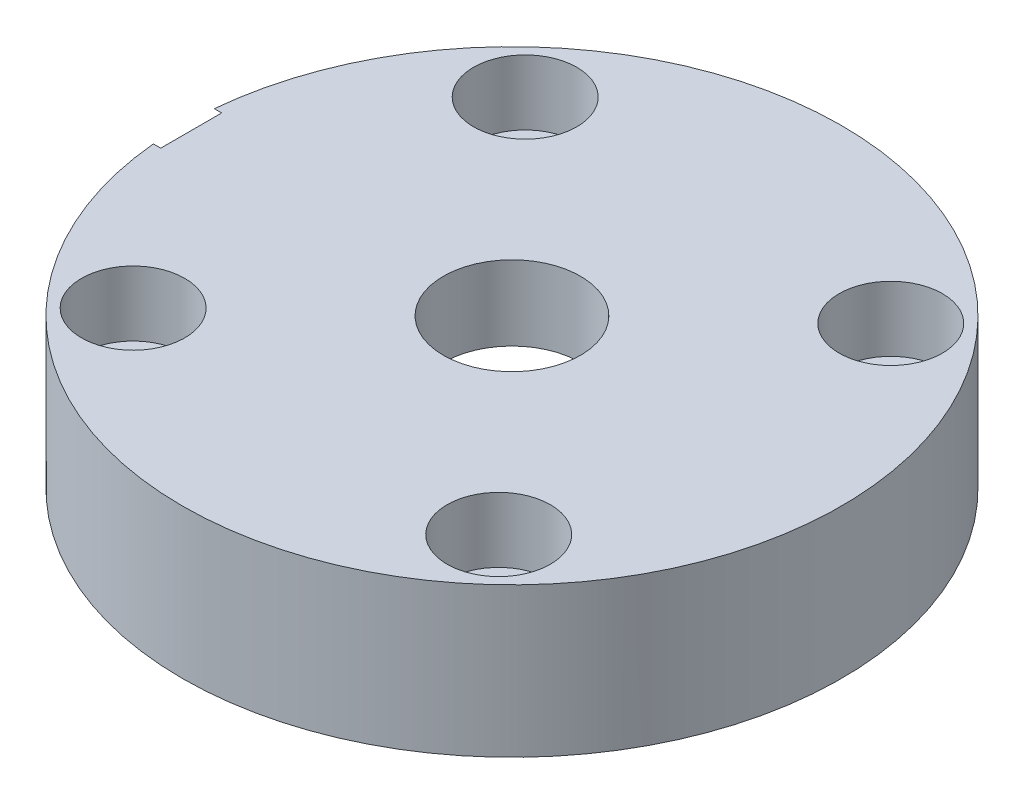
ISO-10303-21;
HEADER;
FILE_DESCRIPTION(('STEP AP214'),'2;1');
FILE_NAME('part.step','',(''),(''),'','','');
FILE_SCHEMA(('AUTOMOTIVE_DESIGN { 1 0 10303 214 1 1 1 1 }'));
ENDSEC;
DATA;
#1=APPLICATION_CONTEXT('core data for automotive mechanical design processes');
#2=APPLICATION_PROTOCOL_DEFINITION('international standard','automotive_design',2000,#1);
#3=PRODUCT_CONTEXT('',#1,'mechanical');
#4=PRODUCT('Part','Part','',(#3));
#5=PRODUCT_RELATED_PRODUCT_CATEGORY('part','',(#4));
#6=PRODUCT_DEFINITION_FORMATION('','',#4);
#7=PRODUCT_DEFINITION_CONTEXT('part definition',#1,'design');
#8=PRODUCT_DEFINITION('design','',#6,#7);
#9=PRODUCT_DEFINITION_SHAPE('','',#8);
#10=(LENGTH_UNIT() NAMED_UNIT(*) SI_UNIT(.MILLI.,.METRE.));
#11=(NAMED_UNIT(*) PLANE_ANGLE_UNIT() SI_UNIT($,.RADIAN.));
#12=(NAMED_UNIT(*) SI_UNIT($,.STERADIAN.) SOLID_ANGLE_UNIT());
#13=UNCERTAINTY_MEASURE_WITH_UNIT(LENGTH_MEASURE(1.E-05),#10,'distance_accuracy_value','');
#14=(GEOMETRIC_REPRESENTATION_CONTEXT(3) GLOBAL_UNCERTAINTY_ASSIGNED_CONTEXT((#13)) GLOBAL_UNIT_ASSIGNED_CONTEXT((#10,
#11,#12)) REPRESENTATION_CONTEXT('',''));
#15=CARTESIAN_POINT('',(0.,0.,0.));
#16=DIRECTION('',(0.,0.,1.));
#17=DIRECTION('',(1.,0.,0.));
#18=AXIS2_PLACEMENT_3D('',#15,#16,#17);
#19=CARTESIAN_POINT('',(-7.87399999990157,5.08,0.));
#20=DIRECTION('',(-1.,0.,0.));
#21=DIRECTION('',(0.,0.,1.));
#22=AXIS2_PLACEMENT_3D('',#19,#20,#21);
#23=CONICAL_SURFACE('',#22,1.983739999766,1.04719755101781);
#24=CARTESIAN_POINT('',(-6.72868717691699,5.08000000024822,0.));
#25=VERTEX_POINT('',#24);
#26=VERTEX_LOOP('',#25);
#27=FACE_BOUND('',#26,.T.);
#28=CARTESIAN_POINT('',(-7.87400000002046,4.31799999998885,1.8315513608851));
#29=CARTESIAN_POINT('',(-7.82992641507165,4.31799999999599,1.7487874157982));
#30=CARTESIAN_POINT('',(-7.78612853155752,4.31799999999893,1.66587183864565));
#31=CARTESIAN_POINT('',(-7.69951532697555,4.31800000000108,1.49941735932508));
#32=CARTESIAN_POINT('',(-7.65670110926625,4.31800000000029,1.4158778843539));
#33=CARTESIAN_POINT('',(-7.57033367638741,4.31799999999969,1.24354391983241));
#34=CARTESIAN_POINT('',(-7.52686338570844,4.31799999999994,1.15470731721397));
#35=CARTESIAN_POINT('',(-7.4638282424196,4.31800000000003,1.02045059617735));
#36=CARTESIAN_POINT('',(-7.44318188491735,4.31800000000001,0.975539839632032));
#37=CARTESIAN_POINT('',(-7.4028656854967,4.31799999999999,0.88528360930255));
#38=CARTESIAN_POINT('',(-7.38319577512093,4.318,0.839938166260351));
#39=CARTESIAN_POINT('',(-7.34376060487868,4.318,0.745289070746328));
#40=CARTESIAN_POINT('',(-7.3240976091331,4.318,0.69594240252209));
#41=CARTESIAN_POINT('',(-7.28693048358289,4.318,0.596410046130136));
#42=CARTESIAN_POINT('',(-7.26942712282796,4.318,0.546224066264776));
#43=CARTESIAN_POINT('',(-7.23782362064461,4.318,0.445817244694537));
#44=CARTESIAN_POINT('',(-7.22366519781957,4.318,0.395615139230935));
#45=CARTESIAN_POINT('',(-7.19953652322499,4.318,0.294233784560262));
#46=CARTESIAN_POINT('',(-7.18956155964946,4.318,0.243055702907522));
#47=CARTESIAN_POINT('',(-7.17638225084909,4.318,0.149378599825421));
#48=CARTESIAN_POINT('',(-7.1722714281669,4.318,0.107010084573329));
#49=CARTESIAN_POINT('',(-7.16813574122286,4.318,0.0220823809694541));
#50=CARTESIAN_POINT('',(-7.16810925530471,4.318,-0.020476724997631));
#51=CARTESIAN_POINT('',(-7.17217831317842,4.318,-0.106140326277238));
#52=CARTESIAN_POINT('',(-7.17634630374353,4.318,-0.1492412625259));
#53=CARTESIAN_POINT('',(-7.18843183722638,4.318,-0.234905726770033));
#54=CARTESIAN_POINT('',(-7.19635034442225,4.318,-0.277469113667662));
#55=CARTESIAN_POINT('',(-7.22130051202808,4.318,-0.38921137660387));
#56=CARTESIAN_POINT('',(-7.24091400946646,4.318,-0.457802750432506));
#57=CARTESIAN_POINT('',(-7.28532676075777,4.318,-0.593315839970755));
#58=CARTESIAN_POINT('',(-7.31013445530008,4.318,-0.660234637100207));
#59=CARTESIAN_POINT('',(-7.36312317579871,4.318,-0.793223443669407));
#60=CARTESIAN_POINT('',(-7.39132568943498,4.318,-0.859284762260099));
#61=CARTESIAN_POINT('',(-7.44976755026002,4.318,-0.990433560919312));
#62=CARTESIAN_POINT('',(-7.48000549787957,4.318,-1.05552167328235));
#63=CARTESIAN_POINT('',(-7.53980162534114,4.318,-1.18077415478785));
#64=CARTESIAN_POINT('',(-7.56927312674534,4.318,-1.24098015911951));
#65=CARTESIAN_POINT('',(-7.62905869548584,4.318,-1.36098500583929));
#66=CARTESIAN_POINT('',(-7.65937292043676,4.318,-1.42078376942182));
#67=CARTESIAN_POINT('',(-7.72016672603709,4.318,-1.53921324381936));
#68=CARTESIAN_POINT('',(-7.7506376801483,4.318,-1.59784839629121));
#69=CARTESIAN_POINT('',(-7.81202070273508,4.318,-1.71486748913878));
#70=CARTESIAN_POINT('',(-7.84293265051441,4.318,-1.77325149276679));
#71=CARTESIAN_POINT('',(-7.87400000002975,4.318,-1.83155136088302));
#72=B_SPLINE_CURVE_WITH_KNOTS('',3,(#28,#29,#30,#31,#32,#33,#34,#35,#36,#37,#38,#39,#40,#41,#42,
#43,#44,#45,#46,#47,#48,#49,#50,#51,#52,#53,#54,#55,#56,#57,#58,#59,#60,#61,#62,#63,#64,#65,#66,
#67,#68,#69,#70,#71),.UNSPECIFIED.,.F.,.F.,(4,2,2,2,2,2,2,2,2,2,2,2,2,2,2,2,2,2,2,2,2,4),(0.,
0.281307642365523,0.562916773289566,0.859585824160608,1.00786515542674,1.15613407630821,
1.31545920995369,1.47484091679935,1.63119792479809,1.78737835277337,1.91490226065231,
2.04237553595827,2.1720889661006,2.30183576438626,2.51548453077995,2.7294832139832,
2.94491568673733,3.16020151160627,3.36128974921865,3.56241585281412,3.76065360187342,
3.95883809795668),.UNSPECIFIED.);
#73=CARTESIAN_POINT('',(-7.87400000001428,4.318,1.83155136088839));
#74=VERTEX_POINT('',#73);
#75=CARTESIAN_POINT('',(-7.87400000001833,4.318,-1.831551360896));
#76=VERTEX_POINT('',#75);
#77=EDGE_CURVE('E21',#74,#76,#72,.T.);
#78=ORIENTED_EDGE('',*,*,#77,.F.);
#79=CARTESIAN_POINT('',(-7.874,5.08,0.));
#80=DIRECTION('',(-1.,0.,0.));
#81=DIRECTION('',(0.,-1.,0.));
#82=AXIS2_PLACEMENT_3D('',#79,#80,#81);
#83=CIRCLE('',#82,1.98374);
#84=EDGE_CURVE('E61',#74,#76,#83,.T.);
#85=ORIENTED_EDGE('',*,*,#84,.T.);
#86=EDGE_LOOP('',(#78,#85));
#87=FACE_BOUND('',#86,.T.);
#88=ADVANCED_FACE('F17',(#27,#87),#23,.F.);
#89=CARTESIAN_POINT('',(-6.72868717699777,5.08,0.));
#90=DIRECTION('',(-1.,0.,0.));
#91=DIRECTION('',(0.,-1.,0.));
#92=AXIS2_PLACEMENT_3D('',#89,#90,#91);
#93=CYLINDRICAL_SURFACE('',#92,1.98374);
#94=CARTESIAN_POINT('',(-18.1127399999923,5.08,0.));
#95=DIRECTION('',(-1.,0.,0.));
#96=DIRECTION('',(0.,-1.,0.));
#97=AXIS2_PLACEMENT_3D('',#94,#95,#96);
#98=CIRCLE('',#97,1.98373999999338);
#99=CARTESIAN_POINT('',(-18.1127399999923,3.09626000000662,0.));
#100=VERTEX_POINT('',#99);
#101=EDGE_CURVE('E82',#100,#100,#98,.T.);
#102=ORIENTED_EDGE('',*,*,#101,.T.);
#103=EDGE_LOOP('',(#102));
#104=FACE_BOUND('',#103,.T.);
#105=ORIENTED_EDGE('',*,*,#84,.F.);
#106=DIRECTION('',(1.,0.,0.));
#107=VECTOR('',#106,1.);
#108=CARTESIAN_POINT('',(0.,4.318,1.831551360896));
#109=LINE('',#108,#107);
#110=CARTESIAN_POINT('',(-10.1484488160704,4.318,1.831551360896));
#111=VERTEX_POINT('',#110);
#112=EDGE_CURVE('E74',#111,#74,#109,.T.);
#113=ORIENTED_EDGE('',*,*,#112,.F.);
#114=CARTESIAN_POINT('',(-10.1484488160704,4.318,1.831551360896));
#115=CARTESIAN_POINT('',(-10.1523307295266,4.26627741997668,1.81003212563262));
#116=CARTESIAN_POINT('',(-10.15653749903,4.21551387213309,1.78634128802486));
#117=CARTESIAN_POINT('',(-10.1654720150666,4.11621010978478,1.73478131015529));
#118=CARTESIAN_POINT('',(-10.1701997016872,4.06766964050244,1.70691265026827));
#119=CARTESIAN_POINT('',(-10.1849570570044,3.92597187191448,1.61737304930524));
#120=CARTESIAN_POINT('',(-10.1955740427077,3.83657361776582,1.54969974576053));
#121=CARTESIAN_POINT('',(-10.2171581892262,3.67047336798419,1.4003405696009));
#122=CARTESIAN_POINT('',(-10.2281254202561,3.59377393742458,1.31865187274376));
#123=CARTESIAN_POINT('',(-10.2491864676427,3.45514512602281,1.14347585732607));
#124=CARTESIAN_POINT('',(-10.2592804042456,3.39321370966328,1.04999016749801));
#125=CARTESIAN_POINT('',(-10.2774852960261,3.28579964890034,0.853593190312653));
#126=CARTESIAN_POINT('',(-10.2855925327254,3.24034777394583,0.750664716279642));
#127=CARTESIAN_POINT('',(-10.2988824125913,3.16743537675203,0.538430418401742));
#128=CARTESIAN_POINT('',(-10.3040650614484,3.13997481950688,0.42912460696574));
#129=CARTESIAN_POINT('',(-10.3108620074707,3.10419314226036,0.208966054624749));
#130=CARTESIAN_POINT('',(-10.3125275777648,3.09559693772034,0.0981595874973831));
#131=CARTESIAN_POINT('',(-10.3122570681653,3.09700288063558,-0.123326019492646));
#132=CARTESIAN_POINT('',(-10.3103212299676,3.10700378001201,-0.234005167401088));
#133=CARTESIAN_POINT('',(-10.303102825486,3.14508450537033,-0.450921697192625));
#134=CARTESIAN_POINT('',(-10.2978545354903,3.17297921917175,-0.557192830172799));
#135=CARTESIAN_POINT('',(-10.2846156137339,3.24581777185274,-0.763525760558362));
#136=CARTESIAN_POINT('',(-10.2766250787238,3.29076100924008,-0.863587776883884));
#137=CARTESIAN_POINT('',(-10.258674292042,3.39691372158333,-1.05574956711831));
#138=CARTESIAN_POINT('',(-10.2486958336015,3.45827549792353,-1.14776349728511));
#139=CARTESIAN_POINT('',(-10.2279021946964,3.59534570125691,-1.32029409940203));
#140=CARTESIAN_POINT('',(-10.2170868413331,3.67105709752548,-1.40080838574683));
#141=CARTESIAN_POINT('',(-10.1956355812196,3.83606527298908,-1.54930006696661));
#142=CARTESIAN_POINT('',(-10.185004621706,3.92554476283416,-1.61707660247916));
#143=CARTESIAN_POINT('',(-10.170227729714,4.06738572977835,-1.70674650905111));
#144=CARTESIAN_POINT('',(-10.1654936100975,4.11597948240959,-1.73465534615503));
#145=CARTESIAN_POINT('',(-10.156547364646,4.21539483525796,-1.78628567346737));
#146=CARTESIAN_POINT('',(-10.1523352921309,4.266216662326,-1.81000673605668));
#147=CARTESIAN_POINT('',(-10.1484488160704,4.318,-1.831551360896));
#148=B_SPLINE_CURVE_WITH_KNOTS('',3,(#114,#115,#116,#117,#118,#119,#120,#121,#122,#123,#124,
#125,#126,#127,#128,#129,#130,#131,#132,#133,#134,#135,#136,#137,#138,#139,#140,#141,#142,#143,
#144,#145,#146,#147),.UNSPECIFIED.,.F.,.F.,(4,2,2,2,2,2,2,2,2,2,2,2,2,2,2,2,4),(0.,
0.168357652079969,0.336695960870139,0.672842913717333,1.00905768327299,1.34522608457076,
1.68201896246432,2.01881118505528,2.35065864720445,2.6824838393889,3.01093046505153,
3.33936550380318,3.67095964884576,4.00262248361132,4.33914225790786,4.50767980160798,
4.67623454495431),.UNSPECIFIED.);
#149=CARTESIAN_POINT('',(-10.1484488160704,4.318,-1.831551360896));
#150=VERTEX_POINT('',#149);
#151=EDGE_CURVE('E73',#111,#150,#148,.T.);
#152=ORIENTED_EDGE('',*,*,#151,.T.);
#153=DIRECTION('',(1.,0.,0.));
#154=VECTOR('',#153,1.);
#155=CARTESIAN_POINT('',(0.,4.318,-1.831551360896));
#156=LINE('',#155,#154);
#157=EDGE_CURVE('E80',#76,#150,#156,.F.);
#158=ORIENTED_EDGE('',*,*,#157,.F.);
#159=EDGE_LOOP('',(#105,#113,#152,#158));
#160=FACE_BOUND('',#159,.T.);
#161=ADVANCED_FACE('F68',(#104,#160),#93,.F.);
#162=CARTESIAN_POINT('',(4.14059139895652,4.318,-14.9304902420144));
#163=DIRECTION('',(0.,1.,0.));
#164=DIRECTION('',(0.,0.,1.));
#165=AXIS2_PLACEMENT_3D('',#162,#163,#164);
#166=PLANE('',#165);
#167=CARTESIAN_POINT('',(4.14059139895652,4.318,-14.9304902420144));
#168=DIRECTION('',(0.,1.,0.));
#169=DIRECTION('',(0.,0.,1.));
#170=AXIS2_PLACEMENT_3D('',#167,#168,#169);
#171=CIRCLE('',#170,1.7272);
#172=CARTESIAN_POINT('',(4.14059139895652,4.318,-13.2032902420144));
#173=VERTEX_POINT('',#172);
#174=EDGE_CURVE('E215',#173,#173,#171,.F.);
#175=ORIENTED_EDGE('',*,*,#174,.T.);
#176=EDGE_LOOP('',(#175));
#177=FACE_BOUND('',#176,.T.);
#178=ADVANCED_FACE('F265',(#177),#166,.F.);
#179=CARTESIAN_POINT('',(-4.14059139895652,4.318,14.9304902420144));
#180=DIRECTION('',(0.,1.,0.));
#181=DIRECTION('',(0.,0.,1.));
#182=AXIS2_PLACEMENT_3D('',#179,#180,#181);
#183=PLANE('',#182);
#184=CARTESIAN_POINT('',(-4.14059139895652,4.318,14.9304902420144));
#185=DIRECTION('',(0.,1.,0.));
#186=DIRECTION('',(0.,0.,1.));
#187=AXIS2_PLACEMENT_3D('',#184,#185,#186);
#188=CIRCLE('',#187,1.7272);
#189=CARTESIAN_POINT('',(-4.14059139895652,4.318,16.6576902420144));
#190=VERTEX_POINT('',#189);
#191=EDGE_CURVE('E212',#190,#190,#188,.F.);
#192=ORIENTED_EDGE('',*,*,#191,.T.);
#193=EDGE_LOOP('',(#192));
#194=FACE_BOUND('',#193,.T.);
#195=ADVANCED_FACE('F262',(#194),#183,.F.);
#196=CARTESIAN_POINT('',(14.9304902420144,4.318,4.14059139895652));
#197=DIRECTION('',(0.,1.,0.));
#198=DIRECTION('',(0.,0.,1.));
#199=AXIS2_PLACEMENT_3D('',#196,#197,#198);
#200=PLANE('',#199);
#201=CARTESIAN_POINT('',(14.9304902420144,4.318,4.14059139895652));
#202=DIRECTION('',(0.,1.,0.));
#203=DIRECTION('',(0.,0.,1.));
#204=AXIS2_PLACEMENT_3D('',#201,#202,#203);
#205=CIRCLE('',#204,1.7272);
#206=CARTESIAN_POINT('',(14.9304902420144,4.318,5.86779139895652));
#207=VERTEX_POINT('',#206);
#208=EDGE_CURVE('E197',#207,#207,#205,.F.);
#209=ORIENTED_EDGE('',*,*,#208,.T.);
#210=EDGE_LOOP('',(#209));
#211=FACE_BOUND('',#210,.T.);
#212=ADVANCED_FACE('F258',(#211),#200,.F.);
#213=CARTESIAN_POINT('',(-14.9304902420144,4.318,-4.14059139895652));
#214=DIRECTION('',(0.,1.,0.));
#215=DIRECTION('',(0.,0.,1.));
#216=AXIS2_PLACEMENT_3D('',#213,#214,#215);
#217=PLANE('',#216);
#218=CARTESIAN_POINT('',(-14.9304902420144,4.318,-4.14059139895652));
#219=DIRECTION('',(0.,1.,0.));
#220=DIRECTION('',(0.,0.,1.));
#221=AXIS2_PLACEMENT_3D('',#218,#219,#220);
#222=CIRCLE('',#221,1.7272);
#223=CARTESIAN_POINT('',(-14.9304902420144,4.318,-2.41339139895652));
#224=VERTEX_POINT('',#223);
#225=EDGE_CURVE('E194',#224,#224,#222,.F.);
#226=ORIENTED_EDGE('',*,*,#225,.T.);
#227=EDGE_LOOP('',(#226));
#228=FACE_BOUND('',#227,.T.);
#229=ADVANCED_FACE('F254',(#228),#217,.F.);
#230=CARTESIAN_POINT('',(-18.5419999999681,5.08,0.));
#231=DIRECTION('',(-1.,0.,0.));
#232=DIRECTION('',(0.,0.,1.));
#233=AXIS2_PLACEMENT_3D('',#230,#231,#232);
#234=CONICAL_SURFACE('',#233,2.41299999996916,0.785398163397448);
#235=CARTESIAN_POINT('',(-18.5420000000249,5.08,0.));
#236=DIRECTION('',(-1.,0.,0.));
#237=DIRECTION('',(0.,0.,1.));
#238=AXIS2_PLACEMENT_3D('',#235,#236,#237);
#239=CIRCLE('',#238,2.41300000002601);
#240=CARTESIAN_POINT('',(-18.5420000000249,5.08,2.41300000002601));
#241=VERTEX_POINT('',#240);
#242=EDGE_CURVE('E191',#241,#241,#239,.F.);
#243=ORIENTED_EDGE('',*,*,#242,.F.);
#244=EDGE_LOOP('',(#243));
#245=FACE_BOUND('',#244,.T.);
#246=ORIENTED_EDGE('',*,*,#101,.F.);
#247=EDGE_LOOP('',(#246));
#248=FACE_BOUND('',#247,.T.);
#249=ADVANCED_FACE('F250',(#245,#248),#234,.F.);
#250=CARTESIAN_POINT('',(9.88263629923953,4.8768,-9.21570743985252));
#251=DIRECTION('',(0.,1.,0.));
#252=DIRECTION('',(0.,0.,1.));
#253=AXIS2_PLACEMENT_3D('',#250,#251,#252);
#254=PLANE('',#253);
#255=CARTESIAN_POINT('',(11.3315942528874,4.8768,-10.5668825908083));
#256=DIRECTION('',(0.,-1.,0.));
#257=DIRECTION('',(0.,0.,-1.));
#258=AXIS2_PLACEMENT_3D('',#255,#256,#257);
#259=CIRCLE('',#258,1.9812);
#260=CARTESIAN_POINT('',(11.3315942528874,4.8768,-12.5480825908083));
#261=VERTEX_POINT('',#260);
#262=EDGE_CURVE('E200',#261,#261,#259,.T.);
#263=ORIENTED_EDGE('',*,*,#262,.T.);
#264=EDGE_LOOP('',(#263));
#265=FACE_BOUND('',#264,.T.);
#266=CARTESIAN_POINT('',(11.3315942528874,4.8768,-10.5668825908083));
#267=DIRECTION('',(0.,-1.,0.));
#268=DIRECTION('',(0.,0.,-1.));
#269=AXIS2_PLACEMENT_3D('',#266,#267,#268);
#270=CIRCLE('',#269,2.9845);
#271=CARTESIAN_POINT('',(11.3315942528874,4.8768,-13.5513825908083));
#272=VERTEX_POINT('',#271);
#273=EDGE_CURVE('E188',#272,#272,#270,.F.);
#274=ORIENTED_EDGE('',*,*,#273,.T.);
#275=EDGE_LOOP('',(#274));
#276=FACE_BOUND('',#275,.T.);
#277=ADVANCED_FACE('F246',(#265,#276),#254,.T.);
#278=CARTESIAN_POINT('',(-9.88263629923953,4.8768,9.21570743985252));
#279=DIRECTION('',(0.,1.,0.));
#280=DIRECTION('',(0.,0.,1.));
#281=AXIS2_PLACEMENT_3D('',#278,#279,#280);
#282=PLANE('',#281);
#283=CARTESIAN_POINT('',(-11.3315942528874,4.8768,10.5668825908083));
#284=DIRECTION('',(0.,-1.,0.));
#285=DIRECTION('',(0.,0.,-1.));
#286=AXIS2_PLACEMENT_3D('',#283,#284,#285);
#287=CIRCLE('',#286,1.9812);
#288=CARTESIAN_POINT('',(-11.3315942528874,4.8768,8.58568259080835));
#289=VERTEX_POINT('',#288);
#290=EDGE_CURVE('E203',#289,#289,#287,.T.);
#291=ORIENTED_EDGE('',*,*,#290,.T.);
#292=EDGE_LOOP('',(#291));
#293=FACE_BOUND('',#292,.T.);
#294=CARTESIAN_POINT('',(-11.3315942528874,4.8768,10.5668825908083));
#295=DIRECTION('',(0.,-1.,0.));
#296=DIRECTION('',(0.,0.,-1.));
#297=AXIS2_PLACEMENT_3D('',#294,#295,#296);
#298=CIRCLE('',#297,2.9845);
#299=CARTESIAN_POINT('',(-11.3315942528874,4.8768,7.58238259080835));
#300=VERTEX_POINT('',#299);
#301=EDGE_CURVE('E185',#300,#300,#298,.F.);
#302=ORIENTED_EDGE('',*,*,#301,.T.);
#303=EDGE_LOOP('',(#302));
#304=FACE_BOUND('',#303,.T.);
#305=ADVANCED_FACE('F242',(#293,#304),#282,.T.);
#306=CARTESIAN_POINT('',(-11.9180577417642,4.8768,-12.7805522065353));
#307=DIRECTION('',(0.,1.,0.));
#308=DIRECTION('',(0.,0.,1.));
#309=AXIS2_PLACEMENT_3D('',#306,#307,#308);
#310=PLANE('',#309);
#311=CARTESIAN_POINT('',(-10.5668825908083,4.8768,-11.3315942528874));
#312=DIRECTION('',(0.,-1.,0.));
#313=DIRECTION('',(0.,0.,-1.));
#314=AXIS2_PLACEMENT_3D('',#311,#312,#313);
#315=CIRCLE('',#314,1.98119999999999);
#316=CARTESIAN_POINT('',(-10.5668825908083,4.8768,-13.3127942528874));
#317=VERTEX_POINT('',#316);
#318=EDGE_CURVE('E206',#317,#317,#315,.T.);
#319=ORIENTED_EDGE('',*,*,#318,.T.);
#320=EDGE_LOOP('',(#319));
#321=FACE_BOUND('',#320,.T.);
#322=CARTESIAN_POINT('',(-10.5668825908083,4.8768,-11.3315942528874));
#323=DIRECTION('',(0.,-1.,0.));
#324=DIRECTION('',(0.,0.,-1.));
#325=AXIS2_PLACEMENT_3D('',#322,#323,#324);
#326=CIRCLE('',#325,2.9845);
#327=CARTESIAN_POINT('',(-10.5668825908083,4.8768,-14.3160942528874));
#328=VERTEX_POINT('',#327);
#329=EDGE_CURVE('E182',#328,#328,#326,.F.);
#330=ORIENTED_EDGE('',*,*,#329,.T.);
#331=EDGE_LOOP('',(#330));
#332=FACE_BOUND('',#331,.T.);
#333=ADVANCED_FACE('F238',(#321,#332),#310,.T.);
#334=CARTESIAN_POINT('',(11.9180577417642,4.8768,12.7805522065353));
#335=DIRECTION('',(0.,1.,0.));
#336=DIRECTION('',(0.,0.,1.));
#337=AXIS2_PLACEMENT_3D('',#334,#335,#336);
#338=PLANE('',#337);
#339=CARTESIAN_POINT('',(10.5668825908083,4.8768,11.3315942528874));
#340=DIRECTION('',(0.,-1.,0.));
#341=DIRECTION('',(0.,0.,-1.));
#342=AXIS2_PLACEMENT_3D('',#339,#340,#341);
#343=CIRCLE('',#342,1.98119999999999);
#344=CARTESIAN_POINT('',(10.5668825908083,4.8768,9.35039425288743));
#345=VERTEX_POINT('',#344);
#346=EDGE_CURVE('E209',#345,#345,#343,.T.);
#347=ORIENTED_EDGE('',*,*,#346,.T.);
#348=EDGE_LOOP('',(#347));
#349=FACE_BOUND('',#348,.T.);
#350=CARTESIAN_POINT('',(10.5668825908083,4.8768,11.3315942528874));
#351=DIRECTION('',(0.,-1.,0.));
#352=DIRECTION('',(0.,0.,-1.));
#353=AXIS2_PLACEMENT_3D('',#350,#351,#352);
#354=CIRCLE('',#353,2.9845);
#355=CARTESIAN_POINT('',(10.5668825908083,4.8768,8.34709425288743));
#356=VERTEX_POINT('',#355);
#357=EDGE_CURVE('E179',#356,#356,#354,.F.);
#358=ORIENTED_EDGE('',*,*,#357,.T.);
#359=EDGE_LOOP('',(#358));
#360=FACE_BOUND('',#359,.T.);
#361=ADVANCED_FACE('F234',(#349,#360),#338,.T.);
#362=CARTESIAN_POINT('',(0.,4.318,0.));
#363=DIRECTION('',(0.,-1.,0.));
#364=DIRECTION('',(0.,0.,-1.));
#365=AXIS2_PLACEMENT_3D('',#362,#363,#364);
#366=PLANE('',#365);
#367=CARTESIAN_POINT('',(0.,4.318,0.));
#368=DIRECTION('',(0.,1.,0.));
#369=DIRECTION('',(0.,0.,1.));
#370=AXIS2_PLACEMENT_3D('',#367,#368,#369);
#371=CIRCLE('',#370,3.9624);
#372=CARTESIAN_POINT('',(0.,4.318,3.9624));
#373=VERTEX_POINT('',#372);
#374=EDGE_CURVE('E176',#373,#373,#371,.T.);
#375=ORIENTED_EDGE('',*,*,#374,.T.);
#376=EDGE_LOOP('',(#375));
#377=FACE_BOUND('',#376,.T.);
#378=ORIENTED_EDGE('',*,*,#112,.T.);
#379=ORIENTED_EDGE('',*,*,#77,.T.);
#380=ORIENTED_EDGE('',*,*,#157,.T.);
#381=CARTESIAN_POINT('',(0.,4.318,0.));
#382=DIRECTION('',(0.,1.,0.));
#383=DIRECTION('',(0.,0.,1.));
#384=AXIS2_PLACEMENT_3D('',#381,#382,#383);
#385=CIRCLE('',#384,10.3124);
#386=EDGE_CURVE('E78',#150,#111,#385,.F.);
#387=ORIENTED_EDGE('',*,*,#386,.T.);
#388=EDGE_LOOP('',(#378,#379,#380,#387));
#389=FACE_BOUND('',#388,.T.);
#390=ADVANCED_FACE('F76',(#377,#389),#366,.T.);
#391=CARTESIAN_POINT('',(0.,0.,0.));
#392=DIRECTION('',(0.,1.,0.));
#393=DIRECTION('',(0.,0.,1.));
#394=AXIS2_PLACEMENT_3D('',#391,#392,#393);
#395=CYLINDRICAL_SURFACE('',#394,10.3124);
#396=ORIENTED_EDGE('',*,*,#151,.F.);
#397=ORIENTED_EDGE('',*,*,#386,.F.);
#398=EDGE_LOOP('',(#396,#397));
#399=FACE_BOUND('',#398,.T.);
#400=CARTESIAN_POINT('',(0.,0.,0.));
#401=DIRECTION('',(0.,1.,0.));
#402=DIRECTION('',(0.,0.,1.));
#403=AXIS2_PLACEMENT_3D('',#400,#401,#402);
#404=CIRCLE('',#403,10.3124);
#405=CARTESIAN_POINT('',(0.,0.,10.3124));
#406=VERTEX_POINT('',#405);
#407=EDGE_CURVE('E173',#406,#406,#404,.F.);
#408=ORIENTED_EDGE('',*,*,#407,.T.);
#409=EDGE_LOOP('',(#408));
#410=FACE_BOUND('',#409,.T.);
#411=ADVANCED_FACE('F224',(#399,#410),#395,.F.);
#412=CARTESIAN_POINT('',(4.14059139895652,4.318,-14.9304902420144));
#413=DIRECTION('',(0.,1.,0.));
#414=DIRECTION('',(0.,0.,1.));
#415=AXIS2_PLACEMENT_3D('',#412,#413,#414);
#416=CYLINDRICAL_SURFACE('',#415,1.7272);
#417=CARTESIAN_POINT('',(4.14059139895652,0.,-14.9304902420144));
#418=DIRECTION('',(0.,1.,0.));
#419=DIRECTION('',(0.,0.,1.));
#420=AXIS2_PLACEMENT_3D('',#417,#418,#419);
#421=CIRCLE('',#420,1.7272);
#422=CARTESIAN_POINT('',(4.14059139895652,0.,-13.2032902420144));
#423=VERTEX_POINT('',#422);
#424=EDGE_CURVE('E170',#423,#423,#421,.F.);
#425=ORIENTED_EDGE('',*,*,#424,.T.);
#426=EDGE_LOOP('',(#425));
#427=FACE_BOUND('',#426,.T.);
#428=ORIENTED_EDGE('',*,*,#174,.F.);
#429=EDGE_LOOP('',(#428));
#430=FACE_BOUND('',#429,.T.);
#431=ADVANCED_FACE('F228',(#427,#430),#416,.F.);
#432=CARTESIAN_POINT('',(-4.14059139895652,4.318,14.9304902420144));
#433=DIRECTION('',(0.,1.,0.));
#434=DIRECTION('',(0.,0.,1.));
#435=AXIS2_PLACEMENT_3D('',#432,#433,#434);
#436=CYLINDRICAL_SURFACE('',#435,1.7272);
#437=CARTESIAN_POINT('',(-4.14059139895652,0.,14.9304902420144));
#438=DIRECTION('',(0.,1.,0.));
#439=DIRECTION('',(0.,0.,1.));
#440=AXIS2_PLACEMENT_3D('',#437,#438,#439);
#441=CIRCLE('',#440,1.7272);
#442=CARTESIAN_POINT('',(-4.14059139895652,0.,16.6576902420144));
#443=VERTEX_POINT('',#442);
#444=EDGE_CURVE('E167',#443,#443,#441,.F.);
#445=ORIENTED_EDGE('',*,*,#444,.T.);
#446=EDGE_LOOP('',(#445));
#447=FACE_BOUND('',#446,.T.);
#448=ORIENTED_EDGE('',*,*,#191,.F.);
#449=EDGE_LOOP('',(#448));
#450=FACE_BOUND('',#449,.T.);
#451=ADVANCED_FACE('F276',(#447,#450),#436,.F.);
#452=CARTESIAN_POINT('',(10.5668825908083,8.636,11.3315942528874));
#453=DIRECTION('',(0.,-1.,0.));
#454=DIRECTION('',(0.,0.,-1.));
#455=AXIS2_PLACEMENT_3D('',#452,#453,#454);
#456=CYLINDRICAL_SURFACE('',#455,1.98119999999999);
#457=CARTESIAN_POINT('',(10.5668825908083,0.,11.3315942528874));
#458=DIRECTION('',(0.,-1.,0.));
#459=DIRECTION('',(0.,0.,-1.));
#460=AXIS2_PLACEMENT_3D('',#457,#458,#459);
#461=CIRCLE('',#460,1.98119999999999);
#462=CARTESIAN_POINT('',(10.5668825908083,0.,9.35039425288743));
#463=VERTEX_POINT('',#462);
#464=EDGE_CURVE('E164',#463,#463,#461,.T.);
#465=ORIENTED_EDGE('',*,*,#464,.T.);
#466=EDGE_LOOP('',(#465));
#467=FACE_BOUND('',#466,.T.);
#468=ORIENTED_EDGE('',*,*,#346,.F.);
#469=EDGE_LOOP('',(#468));
#470=FACE_BOUND('',#469,.T.);
#471=ADVANCED_FACE('F281',(#467,#470),#456,.F.);
#472=CARTESIAN_POINT('',(-10.5668825908083,8.636,-11.3315942528874));
#473=DIRECTION('',(0.,-1.,0.));
#474=DIRECTION('',(0.,0.,-1.));
#475=AXIS2_PLACEMENT_3D('',#472,#473,#474);
#476=CYLINDRICAL_SURFACE('',#475,1.98119999999999);
#477=CARTESIAN_POINT('',(-10.5668825908083,0.,-11.3315942528874));
#478=DIRECTION('',(0.,-1.,0.));
#479=DIRECTION('',(0.,0.,-1.));
#480=AXIS2_PLACEMENT_3D('',#477,#478,#479);
#481=CIRCLE('',#480,1.98119999999999);
#482=CARTESIAN_POINT('',(-10.5668825908083,0.,-13.3127942528874));
#483=VERTEX_POINT('',#482);
#484=EDGE_CURVE('E161',#483,#483,#481,.T.);
#485=ORIENTED_EDGE('',*,*,#484,.T.);
#486=EDGE_LOOP('',(#485));
#487=FACE_BOUND('',#486,.T.);
#488=ORIENTED_EDGE('',*,*,#318,.F.);
#489=EDGE_LOOP('',(#488));
#490=FACE_BOUND('',#489,.T.);
#491=ADVANCED_FACE('F333',(#487,#490),#476,.F.);
#492=CARTESIAN_POINT('',(-11.3315942528874,8.636,10.5668825908083));
#493=DIRECTION('',(0.,-1.,0.));
#494=DIRECTION('',(0.,0.,-1.));
#495=AXIS2_PLACEMENT_3D('',#492,#493,#494);
#496=CYLINDRICAL_SURFACE('',#495,1.9812);
#497=CARTESIAN_POINT('',(-11.3315942528874,0.,10.5668825908083));
#498=DIRECTION('',(0.,-1.,0.));
#499=DIRECTION('',(0.,0.,-1.));
#500=AXIS2_PLACEMENT_3D('',#497,#498,#499);
#501=CIRCLE('',#500,1.9812);
#502=CARTESIAN_POINT('',(-11.3315942528874,0.,8.58568259080835));
#503=VERTEX_POINT('',#502);
#504=EDGE_CURVE('E158',#503,#503,#501,.T.);
#505=ORIENTED_EDGE('',*,*,#504,.T.);
#506=EDGE_LOOP('',(#505));
#507=FACE_BOUND('',#506,.T.);
#508=ORIENTED_EDGE('',*,*,#290,.F.);
#509=EDGE_LOOP('',(#508));
#510=FACE_BOUND('',#509,.T.);
#511=ADVANCED_FACE('F329',(#507,#510),#496,.F.);
#512=CARTESIAN_POINT('',(11.3315942528874,8.636,-10.5668825908083));
#513=DIRECTION('',(0.,-1.,0.));
#514=DIRECTION('',(0.,0.,-1.));
#515=AXIS2_PLACEMENT_3D('',#512,#513,#514);
#516=CYLINDRICAL_SURFACE('',#515,1.9812);
#517=CARTESIAN_POINT('',(11.3315942528874,0.,-10.5668825908083));
#518=DIRECTION('',(0.,-1.,0.));
#519=DIRECTION('',(0.,0.,-1.));
#520=AXIS2_PLACEMENT_3D('',#517,#518,#519);
#521=CIRCLE('',#520,1.9812);
#522=CARTESIAN_POINT('',(11.3315942528874,0.,-12.5480825908083));
#523=VERTEX_POINT('',#522);
#524=EDGE_CURVE('E155',#523,#523,#521,.T.);
#525=ORIENTED_EDGE('',*,*,#524,.T.);
#526=EDGE_LOOP('',(#525));
#527=FACE_BOUND('',#526,.T.);
#528=ORIENTED_EDGE('',*,*,#262,.F.);
#529=EDGE_LOOP('',(#528));
#530=FACE_BOUND('',#529,.T.);
#531=ADVANCED_FACE('F325',(#527,#530),#516,.F.);
#532=CARTESIAN_POINT('',(14.9304902420144,4.318,4.14059139895652));
#533=DIRECTION('',(0.,1.,0.));
#534=DIRECTION('',(0.,0.,1.));
#535=AXIS2_PLACEMENT_3D('',#532,#533,#534);
#536=CYLINDRICAL_SURFACE('',#535,1.7272);
#537=CARTESIAN_POINT('',(14.9304902420144,0.,4.14059139895652));
#538=DIRECTION('',(0.,1.,0.));
#539=DIRECTION('',(0.,0.,1.));
#540=AXIS2_PLACEMENT_3D('',#537,#538,#539);
#541=CIRCLE('',#540,1.7272);
#542=CARTESIAN_POINT('',(14.9304902420144,0.,5.86779139895652));
#543=VERTEX_POINT('',#542);
#544=EDGE_CURVE('E149',#543,#543,#541,.F.);
#545=ORIENTED_EDGE('',*,*,#544,.T.);
#546=EDGE_LOOP('',(#545));
#547=FACE_BOUND('',#546,.T.);
#548=ORIENTED_EDGE('',*,*,#208,.F.);
#549=EDGE_LOOP('',(#548));
#550=FACE_BOUND('',#549,.T.);
#551=ADVANCED_FACE('F321',(#547,#550),#536,.F.);
#552=CARTESIAN_POINT('',(-14.9304902420144,4.318,-4.14059139895652));
#553=DIRECTION('',(0.,1.,0.));
#554=DIRECTION('',(0.,0.,1.));
#555=AXIS2_PLACEMENT_3D('',#552,#553,#554);
#556=CYLINDRICAL_SURFACE('',#555,1.7272);
#557=CARTESIAN_POINT('',(-14.9304902420144,0.,-4.14059139895652));
#558=DIRECTION('',(0.,1.,0.));
#559=DIRECTION('',(0.,0.,1.));
#560=AXIS2_PLACEMENT_3D('',#557,#558,#559);
#561=CIRCLE('',#560,1.7272);
#562=CARTESIAN_POINT('',(-14.9304902420144,0.,-2.41339139895652));
#563=VERTEX_POINT('',#562);
#564=EDGE_CURVE('E145',#563,#563,#561,.F.);
#565=ORIENTED_EDGE('',*,*,#564,.T.);
#566=EDGE_LOOP('',(#565));
#567=FACE_BOUND('',#566,.T.);
#568=ORIENTED_EDGE('',*,*,#225,.F.);
#569=EDGE_LOOP('',(#568));
#570=FACE_BOUND('',#569,.T.);
#571=ADVANCED_FACE('F318',(#567,#570),#556,.F.);
#572=CARTESIAN_POINT('',(-18.542,9.04875,0.));
#573=DIRECTION('',(-1.,0.,0.));
#574=DIRECTION('',(0.,-1.,0.));
#575=AXIS2_PLACEMENT_3D('',#572,#573,#574);
#576=PLANE('',#575);
#577=CARTESIAN_POINT('',(-18.542,5.08,0.));
#578=DIRECTION('',(-1.,0.,0.));
#579=DIRECTION('',(0.,-1.,0.));
#580=AXIS2_PLACEMENT_3D('',#577,#578,#579);
#581=CIRCLE('',#580,3.96875);
#582=CARTESIAN_POINT('',(-18.542,8.636,-1.76233951397));
#583=VERTEX_POINT('',#582);
#584=CARTESIAN_POINT('',(-18.542,8.636,1.76233951397));
#585=VERTEX_POINT('',#584);
#586=EDGE_CURVE('E144',#583,#585,#581,.T.);
#587=ORIENTED_EDGE('',*,*,#586,.T.);
#588=DIRECTION('',(0.,0.,-1.));
#589=VECTOR('',#588,1.);
#590=CARTESIAN_POINT('',(-18.542,8.636,0.));
#591=LINE('',#590,#589);
#592=EDGE_CURVE('E85',#585,#583,#591,.T.);
#593=ORIENTED_EDGE('',*,*,#592,.T.);
#594=EDGE_LOOP('',(#587,#593));
#595=FACE_BOUND('',#594,.T.);
#596=ORIENTED_EDGE('',*,*,#242,.T.);
#597=EDGE_LOOP('',(#596));
#598=FACE_BOUND('',#597,.T.);
#599=ADVANCED_FACE('F314',(#595,#598),#576,.T.);
#600=CARTESIAN_POINT('',(11.3315942528874,8.636,-10.5668825908083));
#601=DIRECTION('',(0.,-1.,0.));
#602=DIRECTION('',(0.,0.,-1.));
#603=AXIS2_PLACEMENT_3D('',#600,#601,#602);
#604=CYLINDRICAL_SURFACE('',#603,2.9845);
#605=ORIENTED_EDGE('',*,*,#273,.F.);
#606=EDGE_LOOP('',(#605));
#607=FACE_BOUND('',#606,.T.);
#608=CARTESIAN_POINT('',(11.3315942528874,8.636,-10.5668825908083));
#609=DIRECTION('',(0.,-1.,0.));
#610=DIRECTION('',(0.,0.,-1.));
#611=AXIS2_PLACEMENT_3D('',#608,#609,#610);
#612=CIRCLE('',#611,2.9845);
#613=CARTESIAN_POINT('',(11.3315942528874,8.636,-13.5513825908083));
#614=VERTEX_POINT('',#613);
#615=EDGE_CURVE('E137',#614,#614,#612,.F.);
#616=ORIENTED_EDGE('',*,*,#615,.T.);
#617=EDGE_LOOP('',(#616));
#618=FACE_BOUND('',#617,.T.);
#619=ADVANCED_FACE('F310',(#607,#618),#604,.F.);
#620=CARTESIAN_POINT('',(-11.3315942528874,8.636,10.5668825908083));
#621=DIRECTION('',(0.,-1.,0.));
#622=DIRECTION('',(0.,0.,-1.));
#623=AXIS2_PLACEMENT_3D('',#620,#621,#622);
#624=CYLINDRICAL_SURFACE('',#623,2.9845);
#625=ORIENTED_EDGE('',*,*,#301,.F.);
#626=EDGE_LOOP('',(#625));
#627=FACE_BOUND('',#626,.T.);
#628=CARTESIAN_POINT('',(-11.3315942528874,8.636,10.5668825908083));
#629=DIRECTION('',(0.,-1.,0.));
#630=DIRECTION('',(0.,0.,-1.));
#631=AXIS2_PLACEMENT_3D('',#628,#629,#630);
#632=CIRCLE('',#631,2.9845);
#633=CARTESIAN_POINT('',(-11.3315942528874,8.636,7.58238259080835));
#634=VERTEX_POINT('',#633);
#635=EDGE_CURVE('E133',#634,#634,#632,.F.);
#636=ORIENTED_EDGE('',*,*,#635,.T.);
#637=EDGE_LOOP('',(#636));
#638=FACE_BOUND('',#637,.T.);
#639=ADVANCED_FACE('F306',(#627,#638),#624,.F.);
#640=CARTESIAN_POINT('',(-10.5668825908083,8.636,-11.3315942528874));
#641=DIRECTION('',(0.,-1.,0.));
#642=DIRECTION('',(0.,0.,-1.));
#643=AXIS2_PLACEMENT_3D('',#640,#641,#642);
#644=CYLINDRICAL_SURFACE('',#643,2.9845);
#645=ORIENTED_EDGE('',*,*,#329,.F.);
#646=EDGE_LOOP('',(#645));
#647=FACE_BOUND('',#646,.T.);
#648=CARTESIAN_POINT('',(-10.5668825908083,8.636,-11.3315942528874));
#649=DIRECTION('',(0.,-1.,0.));
#650=DIRECTION('',(0.,0.,-1.));
#651=AXIS2_PLACEMENT_3D('',#648,#649,#650);
#652=CIRCLE('',#651,2.9845);
#653=CARTESIAN_POINT('',(-10.5668825908083,8.636,-14.3160942528874));
#654=VERTEX_POINT('',#653);
#655=EDGE_CURVE('E129',#654,#654,#652,.F.);
#656=ORIENTED_EDGE('',*,*,#655,.T.);
#657=EDGE_LOOP('',(#656));
#658=FACE_BOUND('',#657,.T.);
#659=ADVANCED_FACE('F302',(#647,#658),#644,.F.);
#660=CARTESIAN_POINT('',(10.5668825908083,8.636,11.3315942528874));
#661=DIRECTION('',(0.,-1.,0.));
#662=DIRECTION('',(0.,0.,-1.));
#663=AXIS2_PLACEMENT_3D('',#660,#661,#662);
#664=CYLINDRICAL_SURFACE('',#663,2.9845);
#665=ORIENTED_EDGE('',*,*,#357,.F.);
#666=EDGE_LOOP('',(#665));
#667=FACE_BOUND('',#666,.T.);
#668=CARTESIAN_POINT('',(10.5668825908083,8.636,11.3315942528874));
#669=DIRECTION('',(0.,-1.,0.));
#670=DIRECTION('',(0.,0.,-1.));
#671=AXIS2_PLACEMENT_3D('',#668,#669,#670);
#672=CIRCLE('',#671,2.9845);
#673=CARTESIAN_POINT('',(10.5668825908083,8.636,8.34709425288743));
#674=VERTEX_POINT('',#673);
#675=EDGE_CURVE('E125',#674,#674,#672,.F.);
#676=ORIENTED_EDGE('',*,*,#675,.T.);
#677=EDGE_LOOP('',(#676));
#678=FACE_BOUND('',#677,.T.);
#679=ADVANCED_FACE('F294',(#667,#678),#664,.F.);
#680=CARTESIAN_POINT('',(0.,0.,0.));
#681=DIRECTION('',(0.,1.,0.));
#682=DIRECTION('',(0.,0.,1.));
#683=AXIS2_PLACEMENT_3D('',#680,#681,#682);
#684=CYLINDRICAL_SURFACE('',#683,3.9624);
#685=CARTESIAN_POINT('',(0.,8.636,0.));
#686=DIRECTION('',(0.,1.,0.));
#687=DIRECTION('',(0.,0.,1.));
#688=AXIS2_PLACEMENT_3D('',#685,#686,#687);
#689=CIRCLE('',#688,3.9624);
#690=CARTESIAN_POINT('',(0.,8.636,3.9624));
#691=VERTEX_POINT('',#690);
#692=EDGE_CURVE('E121',#691,#691,#689,.T.);
#693=ORIENTED_EDGE('',*,*,#692,.T.);
#694=EDGE_LOOP('',(#693));
#695=FACE_BOUND('',#694,.T.);
#696=ORIENTED_EDGE('',*,*,#374,.F.);
#697=EDGE_LOOP('',(#696));
#698=FACE_BOUND('',#697,.T.);
#699=ADVANCED_FACE('F287',(#695,#698),#684,.F.);
#700=CARTESIAN_POINT('',(19.05,0.,0.));
#701=DIRECTION('',(0.,1.,0.));
#702=DIRECTION('',(0.,0.,1.));
#703=AXIS2_PLACEMENT_3D('',#700,#701,#702);
#704=PLANE('',#703);
#705=ORIENTED_EDGE('',*,*,#564,.F.);
#706=EDGE_LOOP('',(#705));
#707=FACE_BOUND('',#706,.T.);
#708=ORIENTED_EDGE('',*,*,#544,.F.);
#709=EDGE_LOOP('',(#708));
#710=FACE_BOUND('',#709,.T.);
#711=CARTESIAN_POINT('',(0.,0.,0.));
#712=DIRECTION('',(0.,1.,0.));
#713=DIRECTION('',(0.,0.,1.));
#714=AXIS2_PLACEMENT_3D('',#711,#712,#713);
#715=CIRCLE('',#714,19.05);
#716=CARTESIAN_POINT('',(0.,0.,19.05));
#717=VERTEX_POINT('',#716);
#718=EDGE_CURVE('E100',#717,#717,#715,.T.);
#719=ORIENTED_EDGE('',*,*,#718,.F.);
#720=EDGE_LOOP('',(#719));
#721=FACE_BOUND('',#720,.T.);
#722=ORIENTED_EDGE('',*,*,#524,.F.);
#723=EDGE_LOOP('',(#722));
#724=FACE_BOUND('',#723,.T.);
#725=ORIENTED_EDGE('',*,*,#504,.F.);
#726=EDGE_LOOP('',(#725));
#727=FACE_BOUND('',#726,.T.);
#728=ORIENTED_EDGE('',*,*,#484,.F.);
#729=EDGE_LOOP('',(#728));
#730=FACE_BOUND('',#729,.T.);
#731=ORIENTED_EDGE('',*,*,#464,.F.);
#732=EDGE_LOOP('',(#731));
#733=FACE_BOUND('',#732,.T.);
#734=ORIENTED_EDGE('',*,*,#444,.F.);
#735=EDGE_LOOP('',(#734));
#736=FACE_BOUND('',#735,.T.);
#737=ORIENTED_EDGE('',*,*,#424,.F.);
#738=EDGE_LOOP('',(#737));
#739=FACE_BOUND('',#738,.T.);
#740=ORIENTED_EDGE('',*,*,#407,.F.);
#741=EDGE_LOOP('',(#740));
#742=FACE_BOUND('',#741,.T.);
#743=ADVANCED_FACE('F117',(#707,#710,#721,#724,#727,#730,#733,#736,#739,#742),#704,.F.);
#744=CARTESIAN_POINT('',(-6.72868717699777,5.08,0.));
#745=DIRECTION('',(-1.,0.,0.));
#746=DIRECTION('',(0.,-1.,0.));
#747=AXIS2_PLACEMENT_3D('',#744,#745,#746);
#748=CYLINDRICAL_SURFACE('',#747,3.96875);
#749=CARTESIAN_POINT('',(-18.968306709812,8.636,1.76233951396999));
#750=CARTESIAN_POINT('',(-18.958973143008,8.58619641595597,1.86285332701888));
#751=CARTESIAN_POINT('',(-18.9490255242818,8.53214126342431,1.96119268943214));
#752=CARTESIAN_POINT('',(-18.9282036775732,8.41596585477278,2.15286953737453));
#753=CARTESIAN_POINT('',(-18.9173295472481,8.35384644828931,2.24620754837621));
#754=CARTESIAN_POINT('',(-18.8949595211944,8.22200196483474,2.4272061282805));
#755=CARTESIAN_POINT('',(-18.8834639304195,8.15228060140374,2.51486943620446));
#756=CARTESIAN_POINT('',(-18.8601743041454,8.00573018806637,2.68395474043861));
#757=CARTESIAN_POINT('',(-18.8483802664707,7.92890108633972,2.76537669123713));
#758=CARTESIAN_POINT('',(-18.8130415561964,7.68846180985588,2.99947333836041));
#759=CARTESIAN_POINT('',(-18.7895254061489,7.5148156123719,3.14209397921449));
#760=CARTESIAN_POINT('',(-18.7452876715467,7.14586200820588,3.39608674481462));
#761=CARTESIAN_POINT('',(-18.7245654930498,6.95055922141973,3.50746551641281));
#762=CARTESIAN_POINT('',(-18.6883165743046,6.54375495856328,3.6957459443969));
#763=CARTESIAN_POINT('',(-18.6727839928002,6.33227202628185,3.77268639690454));
#764=CARTESIAN_POINT('',(-18.64873941695,5.89896331077317,3.88981257071471));
#765=CARTESIAN_POINT('',(-18.640227320372,5.67713767820581,3.92999882723204));
#766=CARTESIAN_POINT('',(-18.6313484869153,5.23405341146186,3.97187670625916));
#767=CARTESIAN_POINT('',(-18.630827607966,5.01286657184159,3.97429681334053));
#768=CARTESIAN_POINT('',(-18.6375957868141,4.57329670753198,3.94243342513674));
#769=CARTESIAN_POINT('',(-18.6448840815895,4.35491341102258,3.9081535157523));
#770=CARTESIAN_POINT('',(-18.6663197260181,3.92896342125706,3.80443821890758));
#771=CARTESIAN_POINT('',(-18.6804097045272,3.72132205758919,3.73529667073165));
#772=CARTESIAN_POINT('',(-18.7138264053601,3.32053739830261,3.56409411206284));
#773=CARTESIAN_POINT('',(-18.733153726959,3.12739576502529,3.46202933412463));
#774=CARTESIAN_POINT('',(-18.7752479826415,2.75778087062878,3.22600499179433));
#775=CARTESIAN_POINT('',(-18.7980642002181,2.58161727621635,3.09156937565959));
#776=CARTESIAN_POINT('',(-18.8443863772706,2.25409951155382,2.795358051084));
#777=CARTESIAN_POINT('',(-18.8678924048525,2.10274780080019,2.63357963549202));
#778=CARTESIAN_POINT('',(-18.913379767912,1.82680767384406,2.28429372661631));
#779=CARTESIAN_POINT('',(-18.9353322468822,1.70266453239126,2.09643020667184));
#780=CARTESIAN_POINT('',(-18.974842871623,1.48773836687205,1.7020724594519));
#781=CARTESIAN_POINT('',(-18.9924012780855,1.39695336358146,1.49557933842436));
#782=CARTESIAN_POINT('',(-19.0210138401898,1.25214555516241,1.07157371465099));
#783=CARTESIAN_POINT('',(-19.0321210406746,1.1978223505717,0.854167524451751));
#784=CARTESIAN_POINT('',(-19.0467981758083,1.12649038306393,0.41307803869341));
#785=CARTESIAN_POINT('',(-19.0503690791397,1.10947682451792,0.189395553607294));
#786=CARTESIAN_POINT('',(-19.0495772317718,1.11328085877481,-0.253484204795387));
#787=CARTESIAN_POINT('',(-19.0453597540993,1.13340572109987,-0.472688033727688));
#788=CARTESIAN_POINT('',(-19.0297412457593,1.2094834061704,-0.904513423398368));
#789=CARTESIAN_POINT('',(-19.0183402156396,1.26543622618358,-1.11713498463872));
#790=CARTESIAN_POINT('',(-18.9896018543378,1.41141158594472,-1.52981412386954));
#791=CARTESIAN_POINT('',(-18.9722664470846,1.50142308484162,-1.72987574895449));
#792=CARTESIAN_POINT('',(-18.9335185849823,1.71289875322802,-2.11218894646345));
#793=CARTESIAN_POINT('',(-18.912105668448,1.83436648498182,-2.29443849853567));
#794=CARTESIAN_POINT('',(-18.867069513541,2.10791786285437,-2.63951874170536));
#795=CARTESIAN_POINT('',(-18.8434130803624,2.26051957816155,-2.80193455206637));
#796=CARTESIAN_POINT('',(-18.7968362957805,2.59078196332186,-3.09905069849851));
#797=CARTESIAN_POINT('',(-18.7739160022984,2.76844459913091,-3.23374885816074));
#798=CARTESIAN_POINT('',(-18.7311738195718,3.1458904635683,-3.47283296916352));
#799=CARTESIAN_POINT('',(-18.7113836082402,3.3458687287423,-3.57691717489517));
#800=CARTESIAN_POINT('',(-18.6774913752077,3.76095608566633,-3.74988482460711));
#801=CARTESIAN_POINT('',(-18.6633886160861,3.97606321159627,-3.81877283234714));
#802=CARTESIAN_POINT('',(-18.642721210832,4.41200351153387,-3.91842106231878));
#803=CARTESIAN_POINT('',(-18.6360503439418,4.63270862748064,-3.9497190619254));
#804=CARTESIAN_POINT('',(-18.6306834804124,5.07634105591598,-3.9749607463178));
#805=CARTESIAN_POINT('',(-18.6319870207985,5.29926823864658,-3.96890659967758));
#806=CARTESIAN_POINT('',(-18.6423242175272,5.73719962728297,-3.92005548210126));
#807=CARTESIAN_POINT('',(-18.6512326241226,5.9522736511782,-3.87785381182771));
#808=CARTESIAN_POINT('',(-18.6755815307074,6.37220346109661,-3.75883035614602));
#809=CARTESIAN_POINT('',(-18.6910216176735,6.5770598923021,-3.68201075974282));
#810=CARTESIAN_POINT('',(-18.7268288487942,6.97254820054594,-3.49534714819804));
#811=CARTESIAN_POINT('',(-18.747232847204,7.16305902726109,-3.38525454475526));
#812=CARTESIAN_POINT('',(-18.7906601126224,7.52323240535834,-3.13522029138339));
#813=CARTESIAN_POINT('',(-18.813684081736,7.69288934281656,-2.9952706314703));
#814=CARTESIAN_POINT('',(-18.8485141610752,7.92978317919434,-2.76446204775276));
#815=CARTESIAN_POINT('',(-18.860294644806,8.00650320524893,-2.68310649950866));
#816=CARTESIAN_POINT('',(-18.8835569249808,8.15284989075131,-2.51416862108585));
#817=CARTESIAN_POINT('',(-18.8950387179518,8.22247646774784,-2.42658621854891));
#818=CARTESIAN_POINT('',(-18.9173832403401,8.35415509563139,-2.24575212905131));
#819=CARTESIAN_POINT('',(-18.9282455913533,8.41620254246069,-2.15249704714791));
#820=CARTESIAN_POINT('',(-18.9490451981353,8.53224822268096,-1.96099811666389));
#821=CARTESIAN_POINT('',(-18.9589823730027,8.58624575240042,-1.86275383296476));
#822=CARTESIAN_POINT('',(-18.968306709812,8.636,-1.76233951396999));
#823=B_SPLINE_CURVE_WITH_KNOTS('',3,(#749,#750,#751,#752,#753,#754,#755,#756,#757,#758,#759,
#760,#761,#762,#763,#764,#765,#766,#767,#768,#769,#770,#771,#772,#773,#774,#775,#776,#777,#778,
#779,#780,#781,#782,#783,#784,#785,#786,#787,#788,#789,#790,#791,#792,#793,#794,#795,#796,#797,
#798,#799,#800,#801,#802,#803,#804,#805,#806,#807,#808,#809,#810,#811,#812,#813,#814,#815,#816,
#817,#818,#819,#820,#821,#822),.UNSPECIFIED.,.F.,.F.,(4,2,2,2,2,2,2,2,2,2,2,2,2,2,2,2,2,2,2,2,2,
2,2,2,2,2,2,2,2,2,2,2,2,2,2,2,4),(0.,0.33757281603946,0.675110094788699,1.01248321982203,
1.34985880473057,2.02418534569581,2.69836831156711,3.37178986038956,4.04520160268767,
4.70560725445807,5.36594838492269,6.0208144645713,6.67575550794353,7.3409896625001,
8.00628971906775,8.6817766310788,9.35722345823893,10.0270348103806,10.6967600626695,
11.3541192135724,12.0114783143439,12.6686245003811,13.3258451375726,13.9950546571899,
14.6643167035624,15.3399697793772,16.0155352235287,16.6813160341803,17.3470581915947,
18.0020427558191,18.6569859090326,19.3169485733201,19.9770885140546,20.3140905703443,
20.6510965433565,20.9883062282828,21.3255453726298),.UNSPECIFIED.);
#824=CARTESIAN_POINT('',(-18.968306709812,8.636,1.76233951396999));
#825=VERTEX_POINT('',#824);
#826=CARTESIAN_POINT('',(-18.968306709812,8.636,-1.76233951397));
#827=VERTEX_POINT('',#826);
#828=EDGE_CURVE('E31',#825,#827,#823,.T.);
#829=ORIENTED_EDGE('',*,*,#828,.F.);
#830=DIRECTION('',(1.,0.,0.));
#831=VECTOR('',#830,1.);
#832=CARTESIAN_POINT('',(0.,8.636,1.76233951396999));
#833=LINE('',#832,#831);
#834=EDGE_CURVE('E142',#825,#585,#833,.T.);
#835=ORIENTED_EDGE('',*,*,#834,.T.);
#836=ORIENTED_EDGE('',*,*,#586,.F.);
#837=DIRECTION('',(1.,0.,0.));
#838=VECTOR('',#837,1.);
#839=CARTESIAN_POINT('',(0.,8.636,-1.76233951397));
#840=LINE('',#839,#838);
#841=EDGE_CURVE('E40',#583,#827,#840,.F.);
#842=ORIENTED_EDGE('',*,*,#841,.T.);
#843=EDGE_LOOP('',(#829,#835,#836,#842));
#844=FACE_BOUND('',#843,.T.);
#845=ADVANCED_FACE('F102',(#844),#748,.F.);
#846=CARTESIAN_POINT('',(0.,8.636,0.));
#847=DIRECTION('',(0.,-1.,0.));
#848=DIRECTION('',(0.,0.,-1.));
#849=AXIS2_PLACEMENT_3D('',#846,#847,#848);
#850=PLANE('',#849);
#851=ORIENTED_EDGE('',*,*,#692,.F.);
#852=EDGE_LOOP('',(#851));
#853=FACE_BOUND('',#852,.T.);
#854=ORIENTED_EDGE('',*,*,#675,.F.);
#855=EDGE_LOOP('',(#854));
#856=FACE_BOUND('',#855,.T.);
#857=ORIENTED_EDGE('',*,*,#655,.F.);
#858=EDGE_LOOP('',(#857));
#859=FACE_BOUND('',#858,.T.);
#860=ORIENTED_EDGE('',*,*,#635,.F.);
#861=EDGE_LOOP('',(#860));
#862=FACE_BOUND('',#861,.T.);
#863=ORIENTED_EDGE('',*,*,#615,.F.);
#864=EDGE_LOOP('',(#863));
#865=FACE_BOUND('',#864,.T.);
#866=ORIENTED_EDGE('',*,*,#841,.F.);
#867=ORIENTED_EDGE('',*,*,#592,.F.);
#868=ORIENTED_EDGE('',*,*,#834,.F.);
#869=CARTESIAN_POINT('',(0.,8.636,0.));
#870=DIRECTION('',(0.,1.,0.));
#871=DIRECTION('',(0.,0.,1.));
#872=AXIS2_PLACEMENT_3D('',#869,#870,#871);
#873=CIRCLE('',#872,19.05);
#874=EDGE_CURVE('E11',#827,#825,#873,.F.);
#875=ORIENTED_EDGE('',*,*,#874,.F.);
#876=EDGE_LOOP('',(#866,#867,#868,#875));
#877=FACE_BOUND('',#876,.T.);
#878=ADVANCED_FACE('F109',(#853,#856,#859,#862,#865,#877),#850,.F.);
#879=CARTESIAN_POINT('',(0.,0.,0.));
#880=DIRECTION('',(0.,1.,0.));
#881=DIRECTION('',(0.,0.,1.));
#882=AXIS2_PLACEMENT_3D('',#879,#880,#881);
#883=CYLINDRICAL_SURFACE('',#882,19.05);
#884=ORIENTED_EDGE('',*,*,#828,.T.);
#885=ORIENTED_EDGE('',*,*,#874,.T.);
#886=EDGE_LOOP('',(#884,#885));
#887=FACE_BOUND('',#886,.T.);
#888=ORIENTED_EDGE('',*,*,#718,.T.);
#889=EDGE_LOOP('',(#888));
#890=FACE_BOUND('',#889,.T.);
#891=ADVANCED_FACE('F106',(#887,#890),#883,.T.);
#892=CLOSED_SHELL('',(#88,#161,#178,#195,#212,#229,#249,#277,#305,#333,#361,#390,#411,#431,#451,
#471,#491,#511,#531,#551,#571,#599,#619,#639,#659,#679,#699,#743,#845,#878,#891));
#893=MANIFOLD_SOLID_BREP('B1',#892);
#894=ADVANCED_BREP_SHAPE_REPRESENTATION('',(#18,#893),#14);
#895=SHAPE_DEFINITION_REPRESENTATION(#9,#894);
ENDSEC;
END-ISO-10303-21;
